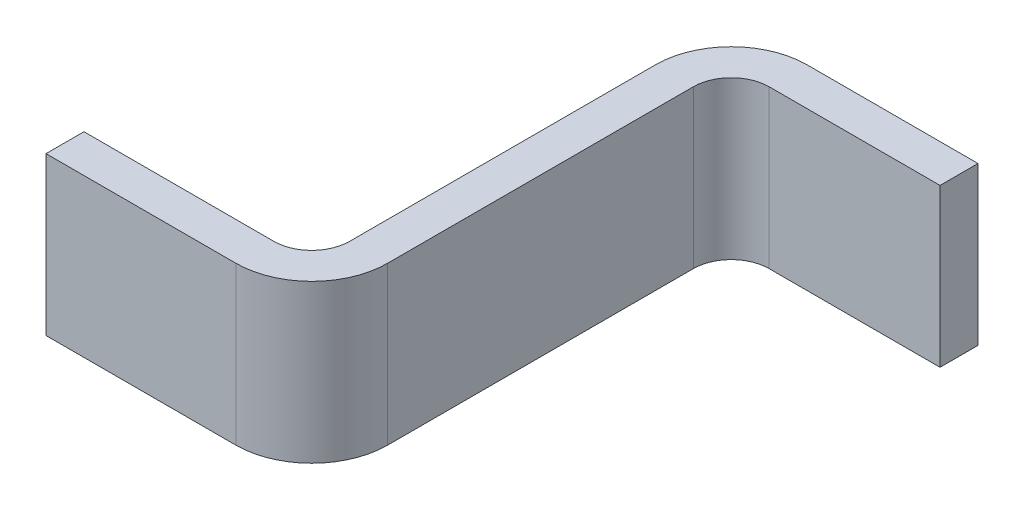
ISO-10303-21;
HEADER;
FILE_DESCRIPTION(('STEP AP214'),'2;1');
FILE_NAME('part.step','',(''),(''),'','','');
FILE_SCHEMA(('AUTOMOTIVE_DESIGN { 1 0 10303 214 1 1 1 1 }'));
ENDSEC;
DATA;
#1=APPLICATION_CONTEXT('core data for automotive mechanical design processes');
#2=APPLICATION_PROTOCOL_DEFINITION('international standard','automotive_design',2000,#1);
#3=PRODUCT_CONTEXT('',#1,'mechanical');
#4=PRODUCT('Part','Part','',(#3));
#5=PRODUCT_RELATED_PRODUCT_CATEGORY('part','',(#4));
#6=PRODUCT_DEFINITION_FORMATION('','',#4);
#7=PRODUCT_DEFINITION_CONTEXT('part definition',#1,'design');
#8=PRODUCT_DEFINITION('design','',#6,#7);
#9=PRODUCT_DEFINITION_SHAPE('','',#8);
#10=(LENGTH_UNIT() NAMED_UNIT(*) SI_UNIT(.MILLI.,.METRE.));
#11=(NAMED_UNIT(*) PLANE_ANGLE_UNIT() SI_UNIT($,.RADIAN.));
#12=(NAMED_UNIT(*) SI_UNIT($,.STERADIAN.) SOLID_ANGLE_UNIT());
#13=UNCERTAINTY_MEASURE_WITH_UNIT(LENGTH_MEASURE(1.E-05),#10,'distance_accuracy_value','');
#14=(GEOMETRIC_REPRESENTATION_CONTEXT(3) GLOBAL_UNCERTAINTY_ASSIGNED_CONTEXT((#13)) GLOBAL_UNIT_ASSIGNED_CONTEXT((#10,
#11,#12)) REPRESENTATION_CONTEXT('',''));
#15=CARTESIAN_POINT('',(0.,0.,0.));
#16=DIRECTION('',(0.,0.,1.));
#17=DIRECTION('',(1.,0.,0.));
#18=AXIS2_PLACEMENT_3D('',#15,#16,#17);
#19=CARTESIAN_POINT('',(0.,0.2075,1.205));
#20=DIRECTION('',(0.,0.,-1.));
#21=DIRECTION('',(-1.,0.,0.));
#22=AXIS2_PLACEMENT_3D('',#19,#20,#21);
#23=PLANE('',#22);
#24=DIRECTION('',(1.,0.,0.));
#25=VECTOR('',#24,1.);
#26=CARTESIAN_POINT('',(0.,0.2075,1.205));
#27=LINE('',#26,#25);
#28=CARTESIAN_POINT('',(0.5,0.2075,1.205));
#29=VERTEX_POINT('',#28);
#30=CARTESIAN_POINT('',(0.,0.2075,1.205));
#31=VERTEX_POINT('',#30);
#32=EDGE_CURVE('E85',#29,#31,#27,.F.);
#33=ORIENTED_EDGE('',*,*,#32,.T.);
#34=DIRECTION('',(0.,1.,0.));
#35=VECTOR('',#34,1.);
#36=CARTESIAN_POINT('',(0.,-0.2075,1.205));
#37=LINE('',#36,#35);
#38=CARTESIAN_POINT('',(0.,-0.2075,1.205));
#39=VERTEX_POINT('',#38);
#40=EDGE_CURVE('E111',#39,#31,#37,.T.);
#41=ORIENTED_EDGE('',*,*,#40,.F.);
#42=DIRECTION('',(1.,0.,0.));
#43=VECTOR('',#42,1.);
#44=CARTESIAN_POINT('',(0.,-0.2075,1.205));
#45=LINE('',#44,#43);
#46=CARTESIAN_POINT('',(0.5,-0.2075,1.205));
#47=VERTEX_POINT('',#46);
#48=EDGE_CURVE('E130',#39,#47,#45,.T.);
#49=ORIENTED_EDGE('',*,*,#48,.T.);
#50=DIRECTION('',(0.,1.,0.));
#51=VECTOR('',#50,1.);
#52=CARTESIAN_POINT('',(0.5,0.2075,1.205));
#53=LINE('',#52,#51);
#54=EDGE_CURVE('E121',#29,#47,#53,.F.);
#55=ORIENTED_EDGE('',*,*,#54,.F.);
#56=EDGE_LOOP('',(#33,#41,#49,#55));
#57=FACE_BOUND('',#56,.T.);
#58=ADVANCED_FACE('F17',(#57),#23,.F.);
#59=CARTESIAN_POINT('',(0.8,0.2075,0.1));
#60=DIRECTION('',(0.,0.,-1.));
#61=DIRECTION('',(-1.,0.,0.));
#62=AXIS2_PLACEMENT_3D('',#59,#60,#61);
#63=PLANE('',#62);
#64=DIRECTION('',(1.,0.,0.));
#65=VECTOR('',#64,1.);
#66=CARTESIAN_POINT('',(0.8,0.2075,0.1));
#67=LINE('',#66,#65);
#68=CARTESIAN_POINT('',(1.25,0.2075,0.1));
#69=VERTEX_POINT('',#68);
#70=CARTESIAN_POINT('',(0.8,0.2075,0.1));
#71=VERTEX_POINT('',#70);
#72=EDGE_CURVE('E142',#69,#71,#67,.F.);
#73=ORIENTED_EDGE('',*,*,#72,.T.);
#74=DIRECTION('',(0.,-1.,0.));
#75=VECTOR('',#74,1.);
#76=CARTESIAN_POINT('',(0.8,0.2075,0.1));
#77=LINE('',#76,#75);
#78=CARTESIAN_POINT('',(0.8,-0.2075,0.1));
#79=VERTEX_POINT('',#78);
#80=EDGE_CURVE('E189',#71,#79,#77,.T.);
#81=ORIENTED_EDGE('',*,*,#80,.T.);
#82=DIRECTION('',(1.,0.,0.));
#83=VECTOR('',#82,1.);
#84=CARTESIAN_POINT('',(0.8,-0.2075,0.1));
#85=LINE('',#84,#83);
#86=CARTESIAN_POINT('',(1.25,-0.2075,0.1));
#87=VERTEX_POINT('',#86);
#88=EDGE_CURVE('E193',#79,#87,#85,.T.);
#89=ORIENTED_EDGE('',*,*,#88,.T.);
#90=DIRECTION('',(0.,1.,0.));
#91=VECTOR('',#90,1.);
#92=CARTESIAN_POINT('',(1.25,-0.2075,0.1));
#93=LINE('',#92,#91);
#94=EDGE_CURVE('E96',#87,#69,#93,.T.);
#95=ORIENTED_EDGE('',*,*,#94,.T.);
#96=EDGE_LOOP('',(#73,#81,#89,#95));
#97=FACE_BOUND('',#96,.T.);
#98=ADVANCED_FACE('F230',(#97),#63,.F.);
#99=CARTESIAN_POINT('',(0.,-0.2075,1.105));
#100=DIRECTION('',(-1.,0.,0.));
#101=DIRECTION('',(0.,0.,1.));
#102=AXIS2_PLACEMENT_3D('',#99,#100,#101);
#103=PLANE('',#102);
#104=DIRECTION('',(0.,0.,1.));
#105=VECTOR('',#104,1.);
#106=CARTESIAN_POINT('',(0.,0.2075,1.105));
#107=LINE('',#106,#105);
#108=CARTESIAN_POINT('',(0.,0.2075,1.105));
#109=VERTEX_POINT('',#108);
#110=EDGE_CURVE('E114',#31,#109,#107,.F.);
#111=ORIENTED_EDGE('',*,*,#110,.T.);
#112=DIRECTION('',(0.,1.,0.));
#113=VECTOR('',#112,1.);
#114=CARTESIAN_POINT('',(0.,-0.2075,1.105));
#115=LINE('',#114,#113);
#116=CARTESIAN_POINT('',(0.,-0.2075,1.105));
#117=VERTEX_POINT('',#116);
#118=EDGE_CURVE('E175',#109,#117,#115,.F.);
#119=ORIENTED_EDGE('',*,*,#118,.T.);
#120=DIRECTION('',(0.,0.,1.));
#121=VECTOR('',#120,1.);
#122=CARTESIAN_POINT('',(0.,-0.2075,1.205));
#123=LINE('',#122,#121);
#124=EDGE_CURVE('E116',#117,#39,#123,.T.);
#125=ORIENTED_EDGE('',*,*,#124,.T.);
#126=ORIENTED_EDGE('',*,*,#40,.T.);
#127=EDGE_LOOP('',(#111,#119,#125,#126));
#128=FACE_BOUND('',#127,.T.);
#129=ADVANCED_FACE('F112',(#128),#103,.T.);
#130=CARTESIAN_POINT('',(0.5,0.2075,1.005));
#131=DIRECTION('',(0.,1.,0.));
#132=DIRECTION('',(0.,0.,1.));
#133=AXIS2_PLACEMENT_3D('',#130,#131,#132);
#134=CYLINDRICAL_SURFACE('',#133,0.2);
#135=CARTESIAN_POINT('',(0.5,0.2075,1.005));
#136=DIRECTION('',(0.,1.,0.));
#137=DIRECTION('',(0.,0.,1.));
#138=AXIS2_PLACEMENT_3D('',#135,#136,#137);
#139=CIRCLE('',#138,0.2);
#140=CARTESIAN_POINT('',(0.7,0.2075,1.005));
#141=VERTEX_POINT('',#140);
#142=EDGE_CURVE('E20',#29,#141,#139,.T.);
#143=ORIENTED_EDGE('',*,*,#142,.F.);
#144=ORIENTED_EDGE('',*,*,#54,.T.);
#145=CARTESIAN_POINT('',(0.5,-0.2075,1.005));
#146=DIRECTION('',(0.,1.,0.));
#147=DIRECTION('',(0.,0.,1.));
#148=AXIS2_PLACEMENT_3D('',#145,#146,#147);
#149=CIRCLE('',#148,0.2);
#150=CARTESIAN_POINT('',(0.7,-0.2075,1.005));
#151=VERTEX_POINT('',#150);
#152=EDGE_CURVE('E166',#151,#47,#149,.F.);
#153=ORIENTED_EDGE('',*,*,#152,.F.);
#154=DIRECTION('',(0.,1.,0.));
#155=VECTOR('',#154,1.);
#156=CARTESIAN_POINT('',(0.7,0.2075,1.005));
#157=LINE('',#156,#155);
#158=EDGE_CURVE('E168',#151,#141,#157,.T.);
#159=ORIENTED_EDGE('',*,*,#158,.T.);
#160=EDGE_LOOP('',(#143,#144,#153,#159));
#161=FACE_BOUND('',#160,.T.);
#162=ADVANCED_FACE('F220',(#161),#134,.T.);
#163=CARTESIAN_POINT('',(1.25,-0.2075,0.));
#164=DIRECTION('',(-1.,0.,0.));
#165=DIRECTION('',(0.,0.,1.));
#166=AXIS2_PLACEMENT_3D('',#163,#164,#165);
#167=PLANE('',#166);
#168=DIRECTION('',(0.,0.,1.));
#169=VECTOR('',#168,1.);
#170=CARTESIAN_POINT('',(1.25,0.2075,0.));
#171=LINE('',#170,#169);
#172=CARTESIAN_POINT('',(1.25,0.2075,0.));
#173=VERTEX_POINT('',#172);
#174=EDGE_CURVE('E141',#69,#173,#171,.F.);
#175=ORIENTED_EDGE('',*,*,#174,.F.);
#176=ORIENTED_EDGE('',*,*,#94,.F.);
#177=DIRECTION('',(0.,0.,1.));
#178=VECTOR('',#177,1.);
#179=CARTESIAN_POINT('',(1.25,-0.2075,0.1));
#180=LINE('',#179,#178);
#181=CARTESIAN_POINT('',(1.25,-0.2075,0.));
#182=VERTEX_POINT('',#181);
#183=EDGE_CURVE('E192',#87,#182,#180,.F.);
#184=ORIENTED_EDGE('',*,*,#183,.T.);
#185=DIRECTION('',(0.,1.,0.));
#186=VECTOR('',#185,1.);
#187=CARTESIAN_POINT('',(1.25,-0.2075,0.));
#188=LINE('',#187,#186);
#189=EDGE_CURVE('E161',#182,#173,#188,.T.);
#190=ORIENTED_EDGE('',*,*,#189,.T.);
#191=EDGE_LOOP('',(#175,#176,#184,#190));
#192=FACE_BOUND('',#191,.T.);
#193=ADVANCED_FACE('F232',(#192),#167,.F.);
#194=CARTESIAN_POINT('',(0.8,0.2075,0.2));
#195=DIRECTION('',(0.,-1.,0.));
#196=DIRECTION('',(0.,0.,-1.));
#197=AXIS2_PLACEMENT_3D('',#194,#195,#196);
#198=CYLINDRICAL_SURFACE('',#197,0.1);
#199=CARTESIAN_POINT('',(0.8,0.2075,0.2));
#200=DIRECTION('',(0.,-1.,0.));
#201=DIRECTION('',(0.,0.,-1.));
#202=AXIS2_PLACEMENT_3D('',#199,#200,#201);
#203=CIRCLE('',#202,0.1);
#204=CARTESIAN_POINT('',(0.7,0.2075,0.2));
#205=VERTEX_POINT('',#204);
#206=EDGE_CURVE('E162',#205,#71,#203,.T.);
#207=ORIENTED_EDGE('',*,*,#206,.F.);
#208=DIRECTION('',(0.,1.,0.));
#209=VECTOR('',#208,1.);
#210=CARTESIAN_POINT('',(0.7,0.2075,0.2));
#211=LINE('',#210,#209);
#212=CARTESIAN_POINT('',(0.7,-0.2075,0.2));
#213=VERTEX_POINT('',#212);
#214=EDGE_CURVE('E165',#205,#213,#211,.F.);
#215=ORIENTED_EDGE('',*,*,#214,.T.);
#216=CARTESIAN_POINT('',(0.8,-0.2075,0.2));
#217=DIRECTION('',(0.,-1.,0.));
#218=DIRECTION('',(0.,0.,-1.));
#219=AXIS2_PLACEMENT_3D('',#216,#217,#218);
#220=CIRCLE('',#219,0.1);
#221=EDGE_CURVE('E159',#79,#213,#220,.F.);
#222=ORIENTED_EDGE('',*,*,#221,.F.);
#223=ORIENTED_EDGE('',*,*,#80,.F.);
#224=EDGE_LOOP('',(#207,#215,#222,#223));
#225=FACE_BOUND('',#224,.T.);
#226=ADVANCED_FACE('F226',(#225),#198,.F.);
#227=CARTESIAN_POINT('',(0.,-0.2075,1.105));
#228=DIRECTION('',(0.,0.,1.));
#229=DIRECTION('',(1.,0.,0.));
#230=AXIS2_PLACEMENT_3D('',#227,#228,#229);
#231=PLANE('',#230);
#232=DIRECTION('',(1.,0.,0.));
#233=VECTOR('',#232,1.);
#234=CARTESIAN_POINT('',(0.,-0.2075,1.105));
#235=LINE('',#234,#233);
#236=CARTESIAN_POINT('',(0.5,-0.2075,1.105));
#237=VERTEX_POINT('',#236);
#238=EDGE_CURVE('E169',#117,#237,#235,.T.);
#239=ORIENTED_EDGE('',*,*,#238,.F.);
#240=ORIENTED_EDGE('',*,*,#118,.F.);
#241=DIRECTION('',(1.,0.,0.));
#242=VECTOR('',#241,1.);
#243=CARTESIAN_POINT('',(0.,0.2075,1.105));
#244=LINE('',#243,#242);
#245=CARTESIAN_POINT('',(0.5,0.2075,1.105));
#246=VERTEX_POINT('',#245);
#247=EDGE_CURVE('E128',#246,#109,#244,.F.);
#248=ORIENTED_EDGE('',*,*,#247,.F.);
#249=DIRECTION('',(0.,1.,0.));
#250=VECTOR('',#249,1.);
#251=CARTESIAN_POINT('',(0.5,-0.2075,1.105));
#252=LINE('',#251,#250);
#253=EDGE_CURVE('E155',#246,#237,#252,.F.);
#254=ORIENTED_EDGE('',*,*,#253,.T.);
#255=EDGE_LOOP('',(#239,#240,#248,#254));
#256=FACE_BOUND('',#255,.T.);
#257=ADVANCED_FACE('F266',(#256),#231,.F.);
#258=CARTESIAN_POINT('',(0.7,0.2075,1.005));
#259=DIRECTION('',(-1.,0.,0.));
#260=DIRECTION('',(0.,0.,1.));
#261=AXIS2_PLACEMENT_3D('',#258,#259,#260);
#262=PLANE('',#261);
#263=DIRECTION('',(0.,0.,-1.));
#264=VECTOR('',#263,1.);
#265=CARTESIAN_POINT('',(0.7,0.2075,1.005));
#266=LINE('',#265,#264);
#267=EDGE_CURVE('E158',#205,#141,#266,.F.);
#268=ORIENTED_EDGE('',*,*,#267,.T.);
#269=ORIENTED_EDGE('',*,*,#158,.F.);
#270=DIRECTION('',(0.,0.,1.));
#271=VECTOR('',#270,1.);
#272=CARTESIAN_POINT('',(0.7,-0.2075,1.005));
#273=LINE('',#272,#271);
#274=EDGE_CURVE('E152',#151,#213,#273,.F.);
#275=ORIENTED_EDGE('',*,*,#274,.T.);
#276=ORIENTED_EDGE('',*,*,#214,.F.);
#277=EDGE_LOOP('',(#268,#269,#275,#276));
#278=FACE_BOUND('',#277,.T.);
#279=ADVANCED_FACE('F268',(#278),#262,.F.);
#280=CARTESIAN_POINT('',(0.8,-0.2075,0.));
#281=DIRECTION('',(0.,0.,1.));
#282=DIRECTION('',(1.,0.,0.));
#283=AXIS2_PLACEMENT_3D('',#280,#281,#282);
#284=PLANE('',#283);
#285=DIRECTION('',(1.,0.,0.));
#286=VECTOR('',#285,1.);
#287=CARTESIAN_POINT('',(0.8,-0.2075,0.));
#288=LINE('',#287,#286);
#289=CARTESIAN_POINT('',(0.8,-0.2075,0.));
#290=VERTEX_POINT('',#289);
#291=EDGE_CURVE('E203',#290,#182,#288,.T.);
#292=ORIENTED_EDGE('',*,*,#291,.F.);
#293=DIRECTION('',(0.,-1.,0.));
#294=VECTOR('',#293,1.);
#295=CARTESIAN_POINT('',(0.8,-0.2075,0.));
#296=LINE('',#295,#294);
#297=CARTESIAN_POINT('',(0.8,0.2075,0.));
#298=VERTEX_POINT('',#297);
#299=EDGE_CURVE('E149',#298,#290,#296,.T.);
#300=ORIENTED_EDGE('',*,*,#299,.F.);
#301=DIRECTION('',(1.,0.,0.));
#302=VECTOR('',#301,1.);
#303=CARTESIAN_POINT('',(0.8,0.2075,0.));
#304=LINE('',#303,#302);
#305=EDGE_CURVE('E164',#173,#298,#304,.F.);
#306=ORIENTED_EDGE('',*,*,#305,.F.);
#307=ORIENTED_EDGE('',*,*,#189,.F.);
#308=EDGE_LOOP('',(#292,#300,#306,#307));
#309=FACE_BOUND('',#308,.T.);
#310=ADVANCED_FACE('F238',(#309),#284,.F.);
#311=CARTESIAN_POINT('',(0.6,0.2075,1.005));
#312=DIRECTION('',(0.,-1.,0.));
#313=DIRECTION('',(0.,0.,-1.));
#314=AXIS2_PLACEMENT_3D('',#311,#312,#313);
#315=PLANE('',#314);
#316=DIRECTION('',(0.,0.,-1.));
#317=VECTOR('',#316,1.);
#318=CARTESIAN_POINT('',(0.6,0.2075,1.005));
#319=LINE('',#318,#317);
#320=CARTESIAN_POINT('',(0.6,0.2075,0.2));
#321=VERTEX_POINT('',#320);
#322=CARTESIAN_POINT('',(0.6,0.2075,1.005));
#323=VERTEX_POINT('',#322);
#324=EDGE_CURVE('E148',#321,#323,#319,.F.);
#325=ORIENTED_EDGE('',*,*,#324,.T.);
#326=CARTESIAN_POINT('',(0.5,0.2075,1.005));
#327=DIRECTION('',(0.,1.,0.));
#328=DIRECTION('',(0.,0.,1.));
#329=AXIS2_PLACEMENT_3D('',#326,#327,#328);
#330=CIRCLE('',#329,0.1);
#331=EDGE_CURVE('E156',#323,#246,#330,.F.);
#332=ORIENTED_EDGE('',*,*,#331,.T.);
#333=ORIENTED_EDGE('',*,*,#247,.T.);
#334=ORIENTED_EDGE('',*,*,#110,.F.);
#335=ORIENTED_EDGE('',*,*,#32,.F.);
#336=ORIENTED_EDGE('',*,*,#142,.T.);
#337=ORIENTED_EDGE('',*,*,#267,.F.);
#338=ORIENTED_EDGE('',*,*,#206,.T.);
#339=ORIENTED_EDGE('',*,*,#72,.F.);
#340=ORIENTED_EDGE('',*,*,#174,.T.);
#341=ORIENTED_EDGE('',*,*,#305,.T.);
#342=CARTESIAN_POINT('',(0.8,0.2075,0.2));
#343=DIRECTION('',(0.,-1.,0.));
#344=DIRECTION('',(0.,0.,-1.));
#345=AXIS2_PLACEMENT_3D('',#342,#343,#344);
#346=CIRCLE('',#345,0.2);
#347=EDGE_CURVE('E150',#321,#298,#346,.T.);
#348=ORIENTED_EDGE('',*,*,#347,.F.);
#349=EDGE_LOOP('',(#325,#332,#333,#334,#335,#336,#337,#338,#339,#340,#341,#348));
#350=FACE_BOUND('',#349,.T.);
#351=ADVANCED_FACE('F126',(#350),#315,.F.);
#352=CARTESIAN_POINT('',(0.5,-0.2075,1.005));
#353=DIRECTION('',(0.,1.,0.));
#354=DIRECTION('',(0.,0.,1.));
#355=AXIS2_PLACEMENT_3D('',#352,#353,#354);
#356=CYLINDRICAL_SURFACE('',#355,0.1);
#357=CARTESIAN_POINT('',(0.5,-0.2075,1.005));
#358=DIRECTION('',(0.,1.,0.));
#359=DIRECTION('',(0.,0.,1.));
#360=AXIS2_PLACEMENT_3D('',#357,#358,#359);
#361=CIRCLE('',#360,0.1);
#362=CARTESIAN_POINT('',(0.6,-0.2075,1.005));
#363=VERTEX_POINT('',#362);
#364=EDGE_CURVE('E153',#237,#363,#361,.T.);
#365=ORIENTED_EDGE('',*,*,#364,.F.);
#366=ORIENTED_EDGE('',*,*,#253,.F.);
#367=ORIENTED_EDGE('',*,*,#331,.F.);
#368=DIRECTION('',(0.,1.,0.));
#369=VECTOR('',#368,1.);
#370=CARTESIAN_POINT('',(0.6,-0.2075,1.005));
#371=LINE('',#370,#369);
#372=EDGE_CURVE('E251',#323,#363,#371,.F.);
#373=ORIENTED_EDGE('',*,*,#372,.T.);
#374=EDGE_LOOP('',(#365,#366,#367,#373));
#375=FACE_BOUND('',#374,.T.);
#376=ADVANCED_FACE('F263',(#375),#356,.F.);
#377=CARTESIAN_POINT('',(0.7,-0.2075,1.005));
#378=DIRECTION('',(0.,1.,0.));
#379=DIRECTION('',(0.,0.,1.));
#380=AXIS2_PLACEMENT_3D('',#377,#378,#379);
#381=PLANE('',#380);
#382=ORIENTED_EDGE('',*,*,#274,.F.);
#383=ORIENTED_EDGE('',*,*,#152,.T.);
#384=ORIENTED_EDGE('',*,*,#48,.F.);
#385=ORIENTED_EDGE('',*,*,#124,.F.);
#386=ORIENTED_EDGE('',*,*,#238,.T.);
#387=ORIENTED_EDGE('',*,*,#364,.T.);
#388=DIRECTION('',(0.,0.,-1.));
#389=VECTOR('',#388,1.);
#390=CARTESIAN_POINT('',(0.6,-0.2075,1.005));
#391=LINE('',#390,#389);
#392=CARTESIAN_POINT('',(0.6,-0.2075,0.2));
#393=VERTEX_POINT('',#392);
#394=EDGE_CURVE('E26',#363,#393,#391,.T.);
#395=ORIENTED_EDGE('',*,*,#394,.T.);
#396=CARTESIAN_POINT('',(0.8,-0.2075,0.2));
#397=DIRECTION('',(0.,-1.,0.));
#398=DIRECTION('',(0.,0.,-1.));
#399=AXIS2_PLACEMENT_3D('',#396,#397,#398);
#400=CIRCLE('',#399,0.2);
#401=EDGE_CURVE('E34',#290,#393,#400,.F.);
#402=ORIENTED_EDGE('',*,*,#401,.F.);
#403=ORIENTED_EDGE('',*,*,#291,.T.);
#404=ORIENTED_EDGE('',*,*,#183,.F.);
#405=ORIENTED_EDGE('',*,*,#88,.F.);
#406=ORIENTED_EDGE('',*,*,#221,.T.);
#407=EDGE_LOOP('',(#382,#383,#384,#385,#386,#387,#395,#402,#403,#404,#405,#406));
#408=FACE_BOUND('',#407,.T.);
#409=ADVANCED_FACE('F240',(#408),#381,.F.);
#410=CARTESIAN_POINT('',(0.8,-0.2075,0.2));
#411=DIRECTION('',(0.,-1.,0.));
#412=DIRECTION('',(0.,0.,-1.));
#413=AXIS2_PLACEMENT_3D('',#410,#411,#412);
#414=CYLINDRICAL_SURFACE('',#413,0.2);
#415=ORIENTED_EDGE('',*,*,#401,.T.);
#416=DIRECTION('',(0.,1.,0.));
#417=VECTOR('',#416,1.);
#418=CARTESIAN_POINT('',(0.6,-0.2075,0.2));
#419=LINE('',#418,#417);
#420=EDGE_CURVE('E11',#393,#321,#419,.T.);
#421=ORIENTED_EDGE('',*,*,#420,.T.);
#422=ORIENTED_EDGE('',*,*,#347,.T.);
#423=ORIENTED_EDGE('',*,*,#299,.T.);
#424=EDGE_LOOP('',(#415,#421,#422,#423));
#425=FACE_BOUND('',#424,.T.);
#426=ADVANCED_FACE('F260',(#425),#414,.T.);
#427=CARTESIAN_POINT('',(0.6,-0.2075,1.005));
#428=DIRECTION('',(1.,0.,0.));
#429=DIRECTION('',(0.,0.,-1.));
#430=AXIS2_PLACEMENT_3D('',#427,#428,#429);
#431=PLANE('',#430);
#432=ORIENTED_EDGE('',*,*,#394,.F.);
#433=ORIENTED_EDGE('',*,*,#372,.F.);
#434=ORIENTED_EDGE('',*,*,#324,.F.);
#435=ORIENTED_EDGE('',*,*,#420,.F.);
#436=EDGE_LOOP('',(#432,#433,#434,#435));
#437=FACE_BOUND('',#436,.T.);
#438=ADVANCED_FACE('F258',(#437),#431,.F.);
#439=CLOSED_SHELL('',(#58,#98,#129,#162,#193,#226,#257,#279,#310,#351,#376,#409,#426,#438));
#440=MANIFOLD_SOLID_BREP('B1',#439);
#441=ADVANCED_BREP_SHAPE_REPRESENTATION('',(#18,#440),#14);
#442=SHAPE_DEFINITION_REPRESENTATION(#9,#441);
ENDSEC;
END-ISO-10303-21;
